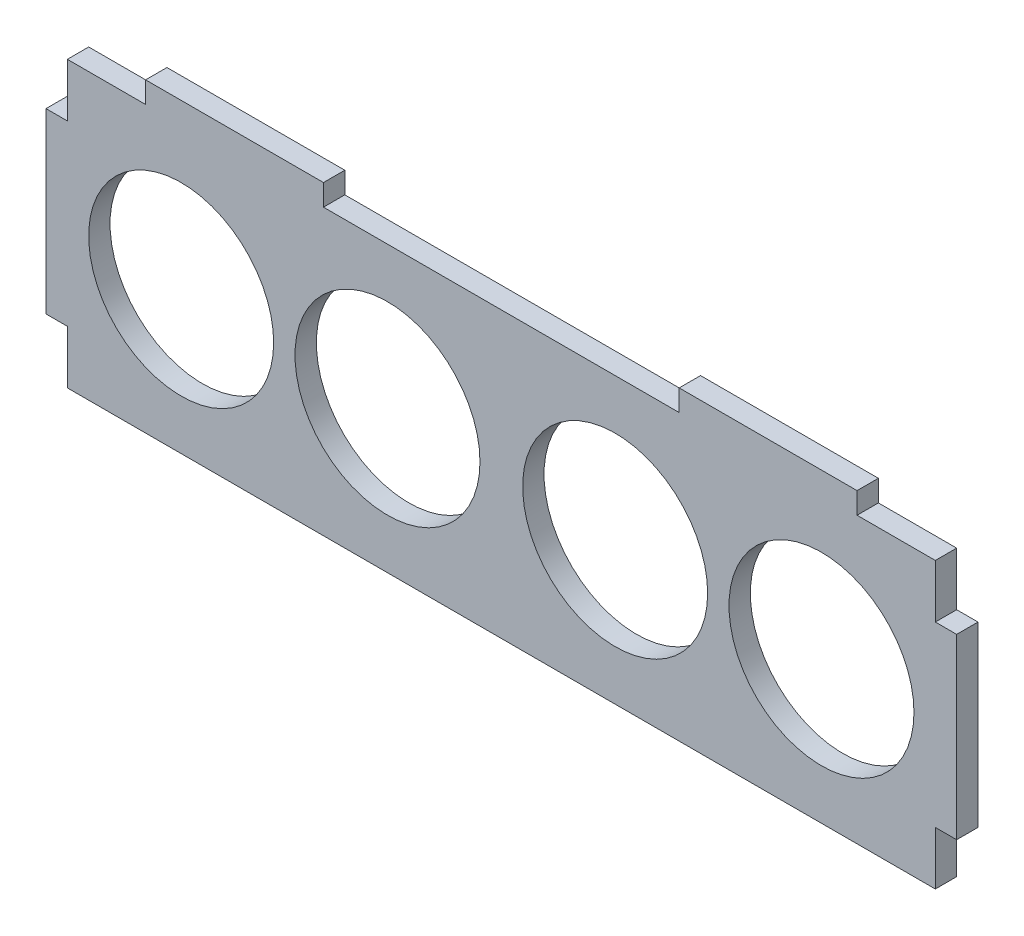
ISO-10303-21;
HEADER;
FILE_DESCRIPTION(('STEP AP214'),'2;1');
FILE_NAME('part.step','',(''),(''),'','','');
FILE_SCHEMA(('AUTOMOTIVE_DESIGN { 1 0 10303 214 1 1 1 1 }'));
ENDSEC;
DATA;
#1=APPLICATION_CONTEXT('core data for automotive mechanical design processes');
#2=APPLICATION_PROTOCOL_DEFINITION('international standard','automotive_design',2000,#1);
#3=PRODUCT_CONTEXT('',#1,'mechanical');
#4=PRODUCT('Part','Part','',(#3));
#5=PRODUCT_RELATED_PRODUCT_CATEGORY('part','',(#4));
#6=PRODUCT_DEFINITION_FORMATION('','',#4);
#7=PRODUCT_DEFINITION_CONTEXT('part definition',#1,'design');
#8=PRODUCT_DEFINITION('design','',#6,#7);
#9=PRODUCT_DEFINITION_SHAPE('','',#8);
#10=(LENGTH_UNIT() NAMED_UNIT(*) SI_UNIT(.MILLI.,.METRE.));
#11=(NAMED_UNIT(*) PLANE_ANGLE_UNIT() SI_UNIT($,.RADIAN.));
#12=(NAMED_UNIT(*) SI_UNIT($,.STERADIAN.) SOLID_ANGLE_UNIT());
#13=UNCERTAINTY_MEASURE_WITH_UNIT(LENGTH_MEASURE(1.E-05),#10,'distance_accuracy_value','');
#14=(GEOMETRIC_REPRESENTATION_CONTEXT(3) GLOBAL_UNCERTAINTY_ASSIGNED_CONTEXT((#13)) GLOBAL_UNIT_ASSIGNED_CONTEXT((#10,
#11,#12)) REPRESENTATION_CONTEXT('',''));
#15=CARTESIAN_POINT('',(0.,0.,0.));
#16=DIRECTION('',(0.,0.,1.));
#17=DIRECTION('',(1.,0.,0.));
#18=AXIS2_PLACEMENT_3D('',#15,#16,#17);
#19=CARTESIAN_POINT('',(0.,12.5,3.));
#20=DIRECTION('',(0.,-1.,0.));
#21=DIRECTION('',(0.,0.,-1.));
#22=AXIS2_PLACEMENT_3D('',#19,#20,#21);
#23=PLANE('',#22);
#24=DIRECTION('',(-1.,0.,0.));
#25=VECTOR('',#24,1.);
#26=CARTESIAN_POINT('',(0.,12.5,0.));
#27=LINE('',#26,#25);
#28=CARTESIAN_POINT('',(-61.,12.5,0.));
#29=VERTEX_POINT('',#28);
#30=CARTESIAN_POINT('',(-64.,12.5,0.));
#31=VERTEX_POINT('',#30);
#32=EDGE_CURVE('E339',#29,#31,#27,.T.);
#33=ORIENTED_EDGE('',*,*,#32,.T.);
#34=DIRECTION('',(0.,0.,-1.));
#35=VECTOR('',#34,1.);
#36=CARTESIAN_POINT('',(-64.,12.5,3.));
#37=LINE('',#36,#35);
#38=CARTESIAN_POINT('',(-64.,12.5,3.));
#39=VERTEX_POINT('',#38);
#40=EDGE_CURVE('E11',#39,#31,#37,.T.);
#41=ORIENTED_EDGE('',*,*,#40,.F.);
#42=DIRECTION('',(-1.,0.,0.));
#43=VECTOR('',#42,1.);
#44=CARTESIAN_POINT('',(0.,12.5,3.));
#45=LINE('',#44,#43);
#46=CARTESIAN_POINT('',(-61.,12.5,3.));
#47=VERTEX_POINT('',#46);
#48=EDGE_CURVE('E260',#47,#39,#45,.T.);
#49=ORIENTED_EDGE('',*,*,#48,.F.);
#50=DIRECTION('',(0.,0.,-1.));
#51=VECTOR('',#50,1.);
#52=CARTESIAN_POINT('',(-61.,12.5,3.));
#53=LINE('',#52,#51);
#54=EDGE_CURVE('E56',#47,#29,#53,.T.);
#55=ORIENTED_EDGE('',*,*,#54,.T.);
#56=EDGE_LOOP('',(#33,#41,#49,#55));
#57=FACE_BOUND('',#56,.T.);
#58=ADVANCED_FACE('F39',(#57),#23,.F.);
#59=CARTESIAN_POINT('',(-64.,0.,3.));
#60=DIRECTION('',(1.,0.,0.));
#61=DIRECTION('',(0.,0.,-1.));
#62=AXIS2_PLACEMENT_3D('',#59,#60,#61);
#63=PLANE('',#62);
#64=DIRECTION('',(0.,-1.,0.));
#65=VECTOR('',#64,1.);
#66=CARTESIAN_POINT('',(-64.,0.,0.));
#67=LINE('',#66,#65);
#68=CARTESIAN_POINT('',(-64.,-12.5,0.));
#69=VERTEX_POINT('',#68);
#70=EDGE_CURVE('E335',#31,#69,#67,.T.);
#71=ORIENTED_EDGE('',*,*,#70,.T.);
#72=DIRECTION('',(0.,0.,-1.));
#73=VECTOR('',#72,1.);
#74=CARTESIAN_POINT('',(-64.,-12.5,3.));
#75=LINE('',#74,#73);
#76=CARTESIAN_POINT('',(-64.,-12.5,3.));
#77=VERTEX_POINT('',#76);
#78=EDGE_CURVE('E48',#77,#69,#75,.T.);
#79=ORIENTED_EDGE('',*,*,#78,.F.);
#80=DIRECTION('',(0.,-1.,0.));
#81=VECTOR('',#80,1.);
#82=CARTESIAN_POINT('',(-64.,0.,3.));
#83=LINE('',#82,#81);
#84=EDGE_CURVE('E130',#39,#77,#83,.T.);
#85=ORIENTED_EDGE('',*,*,#84,.F.);
#86=ORIENTED_EDGE('',*,*,#40,.T.);
#87=EDGE_LOOP('',(#71,#79,#85,#86));
#88=FACE_BOUND('',#87,.T.);
#89=ADVANCED_FACE('F336',(#88),#63,.F.);
#90=CARTESIAN_POINT('',(0.,-12.5,3.));
#91=DIRECTION('',(0.,-1.,0.));
#92=DIRECTION('',(0.,0.,-1.));
#93=AXIS2_PLACEMENT_3D('',#90,#91,#92);
#94=PLANE('',#93);
#95=DIRECTION('',(-1.,0.,0.));
#96=VECTOR('',#95,1.);
#97=CARTESIAN_POINT('',(0.,-12.5,0.));
#98=LINE('',#97,#96);
#99=CARTESIAN_POINT('',(-61.,-12.5,0.));
#100=VERTEX_POINT('',#99);
#101=EDGE_CURVE('E332',#100,#69,#98,.T.);
#102=ORIENTED_EDGE('',*,*,#101,.F.);
#103=DIRECTION('',(0.,0.,-1.));
#104=VECTOR('',#103,1.);
#105=CARTESIAN_POINT('',(-61.,-12.5,3.));
#106=LINE('',#105,#104);
#107=CARTESIAN_POINT('',(-61.,-12.5,3.));
#108=VERTEX_POINT('',#107);
#109=EDGE_CURVE('E324',#108,#100,#106,.T.);
#110=ORIENTED_EDGE('',*,*,#109,.F.);
#111=DIRECTION('',(-1.,0.,0.));
#112=VECTOR('',#111,1.);
#113=CARTESIAN_POINT('',(0.,-12.5,3.));
#114=LINE('',#113,#112);
#115=EDGE_CURVE('E253',#108,#77,#114,.T.);
#116=ORIENTED_EDGE('',*,*,#115,.T.);
#117=ORIENTED_EDGE('',*,*,#78,.T.);
#118=EDGE_LOOP('',(#102,#110,#116,#117));
#119=FACE_BOUND('',#118,.T.);
#120=ADVANCED_FACE('F330',(#119),#94,.T.);
#121=CARTESIAN_POINT('',(-61.,0.,3.));
#122=DIRECTION('',(-1.,0.,0.));
#123=DIRECTION('',(0.,0.,1.));
#124=AXIS2_PLACEMENT_3D('',#121,#122,#123);
#125=PLANE('',#124);
#126=DIRECTION('',(0.,1.,0.));
#127=VECTOR('',#126,1.);
#128=CARTESIAN_POINT('',(-61.,0.,0.));
#129=LINE('',#128,#127);
#130=CARTESIAN_POINT('',(-61.,-20.,0.));
#131=VERTEX_POINT('',#130);
#132=EDGE_CURVE('E345',#131,#100,#129,.T.);
#133=ORIENTED_EDGE('',*,*,#132,.F.);
#134=DIRECTION('',(0.,0.,-1.));
#135=VECTOR('',#134,1.);
#136=CARTESIAN_POINT('',(-61.,-20.,3.));
#137=LINE('',#136,#135);
#138=CARTESIAN_POINT('',(-61.,-20.,3.));
#139=VERTEX_POINT('',#138);
#140=EDGE_CURVE('E321',#139,#131,#137,.T.);
#141=ORIENTED_EDGE('',*,*,#140,.F.);
#142=DIRECTION('',(0.,1.,0.));
#143=VECTOR('',#142,1.);
#144=CARTESIAN_POINT('',(-61.,0.,3.));
#145=LINE('',#144,#143);
#146=EDGE_CURVE('E214',#139,#108,#145,.T.);
#147=ORIENTED_EDGE('',*,*,#146,.T.);
#148=ORIENTED_EDGE('',*,*,#109,.T.);
#149=EDGE_LOOP('',(#133,#141,#147,#148));
#150=FACE_BOUND('',#149,.T.);
#151=ADVANCED_FACE('F508',(#150),#125,.T.);
#152=CARTESIAN_POINT('',(0.,-20.,3.));
#153=DIRECTION('',(0.,1.,0.));
#154=DIRECTION('',(0.,0.,1.));
#155=AXIS2_PLACEMENT_3D('',#152,#153,#154);
#156=PLANE('',#155);
#157=DIRECTION('',(1.,0.,0.));
#158=VECTOR('',#157,1.);
#159=CARTESIAN_POINT('',(0.,-20.,0.));
#160=LINE('',#159,#158);
#161=CARTESIAN_POINT('',(61.,-20.,0.));
#162=VERTEX_POINT('',#161);
#163=EDGE_CURVE('E349',#131,#162,#160,.T.);
#164=ORIENTED_EDGE('',*,*,#163,.T.);
#165=DIRECTION('',(0.,0.,-1.));
#166=VECTOR('',#165,1.);
#167=CARTESIAN_POINT('',(61.,-20.,3.));
#168=LINE('',#167,#166);
#169=CARTESIAN_POINT('',(61.,-20.,3.));
#170=VERTEX_POINT('',#169);
#171=EDGE_CURVE('E317',#170,#162,#168,.T.);
#172=ORIENTED_EDGE('',*,*,#171,.F.);
#173=DIRECTION('',(1.,0.,0.));
#174=VECTOR('',#173,1.);
#175=CARTESIAN_POINT('',(0.,-20.,3.));
#176=LINE('',#175,#174);
#177=EDGE_CURVE('E243',#139,#170,#176,.T.);
#178=ORIENTED_EDGE('',*,*,#177,.F.);
#179=ORIENTED_EDGE('',*,*,#140,.T.);
#180=EDGE_LOOP('',(#164,#172,#178,#179));
#181=FACE_BOUND('',#180,.T.);
#182=ADVANCED_FACE('F506',(#181),#156,.F.);
#183=CARTESIAN_POINT('',(61.,0.,3.));
#184=DIRECTION('',(-1.,0.,0.));
#185=DIRECTION('',(0.,0.,1.));
#186=AXIS2_PLACEMENT_3D('',#183,#184,#185);
#187=PLANE('',#186);
#188=DIRECTION('',(0.,1.,0.));
#189=VECTOR('',#188,1.);
#190=CARTESIAN_POINT('',(61.,0.,0.));
#191=LINE('',#190,#189);
#192=CARTESIAN_POINT('',(61.,-12.5,0.));
#193=VERTEX_POINT('',#192);
#194=EDGE_CURVE('E356',#162,#193,#191,.T.);
#195=ORIENTED_EDGE('',*,*,#194,.T.);
#196=DIRECTION('',(0.,0.,-1.));
#197=VECTOR('',#196,1.);
#198=CARTESIAN_POINT('',(61.,-12.5,3.));
#199=LINE('',#198,#197);
#200=CARTESIAN_POINT('',(61.,-12.5,3.));
#201=VERTEX_POINT('',#200);
#202=EDGE_CURVE('E313',#201,#193,#199,.T.);
#203=ORIENTED_EDGE('',*,*,#202,.F.);
#204=DIRECTION('',(0.,1.,0.));
#205=VECTOR('',#204,1.);
#206=CARTESIAN_POINT('',(61.,0.,3.));
#207=LINE('',#206,#205);
#208=EDGE_CURVE('E232',#170,#201,#207,.T.);
#209=ORIENTED_EDGE('',*,*,#208,.F.);
#210=ORIENTED_EDGE('',*,*,#171,.T.);
#211=EDGE_LOOP('',(#195,#203,#209,#210));
#212=FACE_BOUND('',#211,.T.);
#213=ADVANCED_FACE('F504',(#212),#187,.F.);
#214=CARTESIAN_POINT('',(0.,-12.4999999999999,3.));
#215=DIRECTION('',(0.,1.,0.));
#216=DIRECTION('',(-1.,0.,0.));
#217=AXIS2_PLACEMENT_3D('',#214,#215,#216);
#218=PLANE('',#217);
#219=DIRECTION('',(1.,0.,0.));
#220=VECTOR('',#219,1.);
#221=CARTESIAN_POINT('',(0.,-12.4999999999999,0.));
#222=LINE('',#221,#220);
#223=CARTESIAN_POINT('',(64.,-12.5,0.));
#224=VERTEX_POINT('',#223);
#225=EDGE_CURVE('E359',#193,#224,#222,.T.);
#226=ORIENTED_EDGE('',*,*,#225,.T.);
#227=DIRECTION('',(0.,0.,-1.));
#228=VECTOR('',#227,1.);
#229=CARTESIAN_POINT('',(64.,-12.5,3.));
#230=LINE('',#229,#228);
#231=CARTESIAN_POINT('',(64.,-12.5,3.));
#232=VERTEX_POINT('',#231);
#233=EDGE_CURVE('E310',#232,#224,#230,.T.);
#234=ORIENTED_EDGE('',*,*,#233,.F.);
#235=DIRECTION('',(1.,0.,0.));
#236=VECTOR('',#235,1.);
#237=CARTESIAN_POINT('',(0.,-12.4999999999999,3.));
#238=LINE('',#237,#236);
#239=EDGE_CURVE('E242',#201,#232,#238,.T.);
#240=ORIENTED_EDGE('',*,*,#239,.F.);
#241=ORIENTED_EDGE('',*,*,#202,.T.);
#242=EDGE_LOOP('',(#226,#234,#240,#241));
#243=FACE_BOUND('',#242,.T.);
#244=ADVANCED_FACE('F501',(#243),#218,.F.);
#245=CARTESIAN_POINT('',(64.,0.,3.));
#246=DIRECTION('',(1.,0.,0.));
#247=DIRECTION('',(0.,0.,-1.));
#248=AXIS2_PLACEMENT_3D('',#245,#246,#247);
#249=PLANE('',#248);
#250=DIRECTION('',(0.,-1.,0.));
#251=VECTOR('',#250,1.);
#252=CARTESIAN_POINT('',(64.,0.,0.));
#253=LINE('',#252,#251);
#254=CARTESIAN_POINT('',(64.,12.5,0.));
#255=VERTEX_POINT('',#254);
#256=EDGE_CURVE('E364',#255,#224,#253,.T.);
#257=ORIENTED_EDGE('',*,*,#256,.F.);
#258=DIRECTION('',(0.,0.,-1.));
#259=VECTOR('',#258,1.);
#260=CARTESIAN_POINT('',(64.,12.5,3.));
#261=LINE('',#260,#259);
#262=CARTESIAN_POINT('',(64.,12.5,3.));
#263=VERTEX_POINT('',#262);
#264=EDGE_CURVE('E307',#263,#255,#261,.T.);
#265=ORIENTED_EDGE('',*,*,#264,.F.);
#266=DIRECTION('',(0.,-1.,0.));
#267=VECTOR('',#266,1.);
#268=CARTESIAN_POINT('',(64.,0.,3.));
#269=LINE('',#268,#267);
#270=EDGE_CURVE('E238',#263,#232,#269,.T.);
#271=ORIENTED_EDGE('',*,*,#270,.T.);
#272=ORIENTED_EDGE('',*,*,#233,.T.);
#273=EDGE_LOOP('',(#257,#265,#271,#272));
#274=FACE_BOUND('',#273,.T.);
#275=ADVANCED_FACE('F496',(#274),#249,.T.);
#276=CARTESIAN_POINT('',(0.,12.5,3.));
#277=DIRECTION('',(0.,1.,0.));
#278=DIRECTION('',(0.,0.,1.));
#279=AXIS2_PLACEMENT_3D('',#276,#277,#278);
#280=PLANE('',#279);
#281=DIRECTION('',(1.,0.,0.));
#282=VECTOR('',#281,1.);
#283=CARTESIAN_POINT('',(0.,12.5,0.));
#284=LINE('',#283,#282);
#285=CARTESIAN_POINT('',(61.,12.5,0.));
#286=VERTEX_POINT('',#285);
#287=EDGE_CURVE('E368',#286,#255,#284,.T.);
#288=ORIENTED_EDGE('',*,*,#287,.F.);
#289=DIRECTION('',(0.,0.,-1.));
#290=VECTOR('',#289,1.);
#291=CARTESIAN_POINT('',(61.,12.5,3.));
#292=LINE('',#291,#290);
#293=CARTESIAN_POINT('',(61.,12.5,3.));
#294=VERTEX_POINT('',#293);
#295=EDGE_CURVE('E304',#294,#286,#292,.T.);
#296=ORIENTED_EDGE('',*,*,#295,.F.);
#297=DIRECTION('',(1.,0.,0.));
#298=VECTOR('',#297,1.);
#299=CARTESIAN_POINT('',(0.,12.5,3.));
#300=LINE('',#299,#298);
#301=EDGE_CURVE('E230',#294,#263,#300,.T.);
#302=ORIENTED_EDGE('',*,*,#301,.T.);
#303=ORIENTED_EDGE('',*,*,#264,.T.);
#304=EDGE_LOOP('',(#288,#296,#302,#303));
#305=FACE_BOUND('',#304,.T.);
#306=ADVANCED_FACE('F491',(#305),#280,.T.);
#307=CARTESIAN_POINT('',(61.,20.,0.));
#308=VERTEX_POINT('',#307);
#309=EDGE_CURVE('E360',#286,#308,#191,.T.);
#310=ORIENTED_EDGE('',*,*,#309,.T.);
#311=DIRECTION('',(0.,0.,-1.));
#312=VECTOR('',#311,1.);
#313=CARTESIAN_POINT('',(61.,20.,3.));
#314=LINE('',#313,#312);
#315=CARTESIAN_POINT('',(61.,20.,3.));
#316=VERTEX_POINT('',#315);
#317=EDGE_CURVE('E301',#316,#308,#314,.T.);
#318=ORIENTED_EDGE('',*,*,#317,.F.);
#319=EDGE_CURVE('E224',#294,#316,#207,.T.);
#320=ORIENTED_EDGE('',*,*,#319,.F.);
#321=ORIENTED_EDGE('',*,*,#295,.T.);
#322=EDGE_LOOP('',(#310,#318,#320,#321));
#323=FACE_BOUND('',#322,.T.);
#324=ADVANCED_FACE('F487',(#323),#187,.F.);
#325=CARTESIAN_POINT('',(0.,20.,3.));
#326=DIRECTION('',(0.,1.,0.));
#327=DIRECTION('',(0.,0.,1.));
#328=AXIS2_PLACEMENT_3D('',#325,#326,#327);
#329=PLANE('',#328);
#330=DIRECTION('',(1.,0.,0.));
#331=VECTOR('',#330,1.);
#332=CARTESIAN_POINT('',(0.,20.,0.));
#333=LINE('',#332,#331);
#334=CARTESIAN_POINT('',(50.,20.,0.));
#335=VERTEX_POINT('',#334);
#336=EDGE_CURVE('E372',#335,#308,#333,.T.);
#337=ORIENTED_EDGE('',*,*,#336,.F.);
#338=DIRECTION('',(0.,0.,-1.));
#339=VECTOR('',#338,1.);
#340=CARTESIAN_POINT('',(50.,20.,3.));
#341=LINE('',#340,#339);
#342=CARTESIAN_POINT('',(50.,20.,3.));
#343=VERTEX_POINT('',#342);
#344=EDGE_CURVE('E298',#343,#335,#341,.T.);
#345=ORIENTED_EDGE('',*,*,#344,.F.);
#346=DIRECTION('',(1.,0.,0.));
#347=VECTOR('',#346,1.);
#348=CARTESIAN_POINT('',(0.,20.,3.));
#349=LINE('',#348,#347);
#350=EDGE_CURVE('E210',#343,#316,#349,.T.);
#351=ORIENTED_EDGE('',*,*,#350,.T.);
#352=ORIENTED_EDGE('',*,*,#317,.T.);
#353=EDGE_LOOP('',(#337,#345,#351,#352));
#354=FACE_BOUND('',#353,.T.);
#355=ADVANCED_FACE('F484',(#354),#329,.T.);
#356=CARTESIAN_POINT('',(50.,0.,3.));
#357=DIRECTION('',(-1.,0.,0.));
#358=DIRECTION('',(0.,0.,1.));
#359=AXIS2_PLACEMENT_3D('',#356,#357,#358);
#360=PLANE('',#359);
#361=DIRECTION('',(0.,1.,0.));
#362=VECTOR('',#361,1.);
#363=CARTESIAN_POINT('',(50.,0.,0.));
#364=LINE('',#363,#362);
#365=CARTESIAN_POINT('',(50.,23.,0.));
#366=VERTEX_POINT('',#365);
#367=EDGE_CURVE('E376',#335,#366,#364,.T.);
#368=ORIENTED_EDGE('',*,*,#367,.T.);
#369=DIRECTION('',(0.,0.,-1.));
#370=VECTOR('',#369,1.);
#371=CARTESIAN_POINT('',(50.,23.,3.));
#372=LINE('',#371,#370);
#373=CARTESIAN_POINT('',(50.,23.,3.));
#374=VERTEX_POINT('',#373);
#375=EDGE_CURVE('E295',#374,#366,#372,.T.);
#376=ORIENTED_EDGE('',*,*,#375,.F.);
#377=DIRECTION('',(0.,1.,0.));
#378=VECTOR('',#377,1.);
#379=CARTESIAN_POINT('',(50.,0.,3.));
#380=LINE('',#379,#378);
#381=EDGE_CURVE('E223',#343,#374,#380,.T.);
#382=ORIENTED_EDGE('',*,*,#381,.F.);
#383=ORIENTED_EDGE('',*,*,#344,.T.);
#384=EDGE_LOOP('',(#368,#376,#382,#383));
#385=FACE_BOUND('',#384,.T.);
#386=ADVANCED_FACE('F625',(#385),#360,.F.);
#387=CARTESIAN_POINT('',(0.,23.,3.));
#388=DIRECTION('',(0.,1.,0.));
#389=DIRECTION('',(0.,0.,1.));
#390=AXIS2_PLACEMENT_3D('',#387,#388,#389);
#391=PLANE('',#390);
#392=DIRECTION('',(1.,0.,0.));
#393=VECTOR('',#392,1.);
#394=CARTESIAN_POINT('',(0.,23.,0.));
#395=LINE('',#394,#393);
#396=CARTESIAN_POINT('',(25.,23.,0.));
#397=VERTEX_POINT('',#396);
#398=EDGE_CURVE('E382',#397,#366,#395,.T.);
#399=ORIENTED_EDGE('',*,*,#398,.F.);
#400=DIRECTION('',(0.,0.,-1.));
#401=VECTOR('',#400,1.);
#402=CARTESIAN_POINT('',(25.,23.,3.));
#403=LINE('',#402,#401);
#404=CARTESIAN_POINT('',(25.,23.,3.));
#405=VERTEX_POINT('',#404);
#406=EDGE_CURVE('E292',#405,#397,#403,.T.);
#407=ORIENTED_EDGE('',*,*,#406,.F.);
#408=DIRECTION('',(1.,0.,0.));
#409=VECTOR('',#408,1.);
#410=CARTESIAN_POINT('',(0.,23.,3.));
#411=LINE('',#410,#409);
#412=EDGE_CURVE('E229',#405,#374,#411,.T.);
#413=ORIENTED_EDGE('',*,*,#412,.T.);
#414=ORIENTED_EDGE('',*,*,#375,.T.);
#415=EDGE_LOOP('',(#399,#407,#413,#414));
#416=FACE_BOUND('',#415,.T.);
#417=ADVANCED_FACE('F457',(#416),#391,.T.);
#418=CARTESIAN_POINT('',(25.,0.,3.));
#419=DIRECTION('',(-1.,0.,0.));
#420=DIRECTION('',(0.,0.,1.));
#421=AXIS2_PLACEMENT_3D('',#418,#419,#420);
#422=PLANE('',#421);
#423=DIRECTION('',(0.,1.,0.));
#424=VECTOR('',#423,1.);
#425=CARTESIAN_POINT('',(25.,0.,0.));
#426=LINE('',#425,#424);
#427=CARTESIAN_POINT('',(25.,20.,0.));
#428=VERTEX_POINT('',#427);
#429=EDGE_CURVE('E386',#428,#397,#426,.T.);
#430=ORIENTED_EDGE('',*,*,#429,.F.);
#431=DIRECTION('',(0.,0.,-1.));
#432=VECTOR('',#431,1.);
#433=CARTESIAN_POINT('',(25.,20.,3.));
#434=LINE('',#433,#432);
#435=CARTESIAN_POINT('',(25.,20.,3.));
#436=VERTEX_POINT('',#435);
#437=EDGE_CURVE('E289',#436,#428,#434,.T.);
#438=ORIENTED_EDGE('',*,*,#437,.F.);
#439=DIRECTION('',(0.,1.,0.));
#440=VECTOR('',#439,1.);
#441=CARTESIAN_POINT('',(25.,0.,3.));
#442=LINE('',#441,#440);
#443=EDGE_CURVE('E220',#436,#405,#442,.T.);
#444=ORIENTED_EDGE('',*,*,#443,.T.);
#445=ORIENTED_EDGE('',*,*,#406,.T.);
#446=EDGE_LOOP('',(#430,#438,#444,#445));
#447=FACE_BOUND('',#446,.T.);
#448=ADVANCED_FACE('F464',(#447),#422,.T.);
#449=CARTESIAN_POINT('',(-24.9999999999999,20.,0.));
#450=VERTEX_POINT('',#449);
#451=EDGE_CURVE('E378',#450,#428,#333,.T.);
#452=ORIENTED_EDGE('',*,*,#451,.F.);
#453=DIRECTION('',(0.,0.,-1.));
#454=VECTOR('',#453,1.);
#455=CARTESIAN_POINT('',(-24.9999999999999,20.,3.));
#456=LINE('',#455,#454);
#457=CARTESIAN_POINT('',(-24.9999999999999,20.,3.));
#458=VERTEX_POINT('',#457);
#459=EDGE_CURVE('E286',#458,#450,#456,.T.);
#460=ORIENTED_EDGE('',*,*,#459,.F.);
#461=EDGE_CURVE('E209',#458,#436,#349,.T.);
#462=ORIENTED_EDGE('',*,*,#461,.T.);
#463=ORIENTED_EDGE('',*,*,#437,.T.);
#464=EDGE_LOOP('',(#452,#460,#462,#463));
#465=FACE_BOUND('',#464,.T.);
#466=ADVANCED_FACE('F468',(#465),#329,.T.);
#467=CARTESIAN_POINT('',(-24.9999999999999,0.,3.));
#468=DIRECTION('',(-1.,0.,0.));
#469=DIRECTION('',(0.,0.,1.));
#470=AXIS2_PLACEMENT_3D('',#467,#468,#469);
#471=PLANE('',#470);
#472=DIRECTION('',(0.,1.,0.));
#473=VECTOR('',#472,1.);
#474=CARTESIAN_POINT('',(-24.9999999999999,0.,0.));
#475=LINE('',#474,#473);
#476=CARTESIAN_POINT('',(-24.9999999999999,23.,0.));
#477=VERTEX_POINT('',#476);
#478=EDGE_CURVE('E390',#450,#477,#475,.T.);
#479=ORIENTED_EDGE('',*,*,#478,.T.);
#480=DIRECTION('',(0.,0.,-1.));
#481=VECTOR('',#480,1.);
#482=CARTESIAN_POINT('',(-24.9999999999999,23.,3.));
#483=LINE('',#482,#481);
#484=CARTESIAN_POINT('',(-24.9999999999999,23.,3.));
#485=VERTEX_POINT('',#484);
#486=EDGE_CURVE('E283',#485,#477,#483,.T.);
#487=ORIENTED_EDGE('',*,*,#486,.F.);
#488=DIRECTION('',(0.,1.,0.));
#489=VECTOR('',#488,1.);
#490=CARTESIAN_POINT('',(-24.9999999999999,0.,3.));
#491=LINE('',#490,#489);
#492=EDGE_CURVE('E219',#458,#485,#491,.T.);
#493=ORIENTED_EDGE('',*,*,#492,.F.);
#494=ORIENTED_EDGE('',*,*,#459,.T.);
#495=EDGE_LOOP('',(#479,#487,#493,#494));
#496=FACE_BOUND('',#495,.T.);
#497=ADVANCED_FACE('F472',(#496),#471,.F.);
#498=CARTESIAN_POINT('',(0.,23.,3.));
#499=DIRECTION('',(0.,1.,0.));
#500=DIRECTION('',(0.,0.,1.));
#501=AXIS2_PLACEMENT_3D('',#498,#499,#500);
#502=PLANE('',#501);
#503=DIRECTION('',(1.,0.,0.));
#504=VECTOR('',#503,1.);
#505=CARTESIAN_POINT('',(0.,23.,0.));
#506=LINE('',#505,#504);
#507=CARTESIAN_POINT('',(-49.9999999999999,23.,0.));
#508=VERTEX_POINT('',#507);
#509=EDGE_CURVE('E394',#508,#477,#506,.T.);
#510=ORIENTED_EDGE('',*,*,#509,.F.);
#511=DIRECTION('',(0.,0.,-1.));
#512=VECTOR('',#511,1.);
#513=CARTESIAN_POINT('',(-49.9999999999999,23.,3.));
#514=LINE('',#513,#512);
#515=CARTESIAN_POINT('',(-49.9999999999999,23.,3.));
#516=VERTEX_POINT('',#515);
#517=EDGE_CURVE('E192',#516,#508,#514,.T.);
#518=ORIENTED_EDGE('',*,*,#517,.F.);
#519=DIRECTION('',(1.,0.,0.));
#520=VECTOR('',#519,1.);
#521=CARTESIAN_POINT('',(0.,23.,3.));
#522=LINE('',#521,#520);
#523=EDGE_CURVE('E202',#516,#485,#522,.T.);
#524=ORIENTED_EDGE('',*,*,#523,.T.);
#525=ORIENTED_EDGE('',*,*,#486,.T.);
#526=EDGE_LOOP('',(#510,#518,#524,#525));
#527=FACE_BOUND('',#526,.T.);
#528=ADVANCED_FACE('F476',(#527),#502,.T.);
#529=CARTESIAN_POINT('',(-49.9999999999999,0.,3.));
#530=DIRECTION('',(-1.,0.,0.));
#531=DIRECTION('',(0.,0.,1.));
#532=AXIS2_PLACEMENT_3D('',#529,#530,#531);
#533=PLANE('',#532);
#534=DIRECTION('',(0.,1.,0.));
#535=VECTOR('',#534,1.);
#536=CARTESIAN_POINT('',(-49.9999999999999,0.,0.));
#537=LINE('',#536,#535);
#538=CARTESIAN_POINT('',(-49.9999999999999,20.,0.));
#539=VERTEX_POINT('',#538);
#540=EDGE_CURVE('E187',#539,#508,#537,.T.);
#541=ORIENTED_EDGE('',*,*,#540,.F.);
#542=DIRECTION('',(0.,0.,-1.));
#543=VECTOR('',#542,1.);
#544=CARTESIAN_POINT('',(-49.9999999999999,20.,3.));
#545=LINE('',#544,#543);
#546=CARTESIAN_POINT('',(-49.9999999999999,20.,3.));
#547=VERTEX_POINT('',#546);
#548=EDGE_CURVE('E182',#547,#539,#545,.T.);
#549=ORIENTED_EDGE('',*,*,#548,.F.);
#550=DIRECTION('',(0.,1.,0.));
#551=VECTOR('',#550,1.);
#552=CARTESIAN_POINT('',(-49.9999999999999,0.,3.));
#553=LINE('',#552,#551);
#554=EDGE_CURVE('E185',#547,#516,#553,.T.);
#555=ORIENTED_EDGE('',*,*,#554,.T.);
#556=ORIENTED_EDGE('',*,*,#517,.T.);
#557=EDGE_LOOP('',(#541,#549,#555,#556));
#558=FACE_BOUND('',#557,.T.);
#559=ADVANCED_FACE('F184',(#558),#533,.T.);
#560=CARTESIAN_POINT('',(-61.,20.,0.));
#561=VERTEX_POINT('',#560);
#562=EDGE_CURVE('E377',#561,#539,#333,.T.);
#563=ORIENTED_EDGE('',*,*,#562,.F.);
#564=DIRECTION('',(0.,0.,-1.));
#565=VECTOR('',#564,1.);
#566=CARTESIAN_POINT('',(-61.,20.,3.));
#567=LINE('',#566,#565);
#568=CARTESIAN_POINT('',(-61.,20.,3.));
#569=VERTEX_POINT('',#568);
#570=EDGE_CURVE('E118',#569,#561,#567,.T.);
#571=ORIENTED_EDGE('',*,*,#570,.F.);
#572=EDGE_CURVE('E200',#569,#547,#349,.T.);
#573=ORIENTED_EDGE('',*,*,#572,.T.);
#574=ORIENTED_EDGE('',*,*,#548,.T.);
#575=EDGE_LOOP('',(#563,#571,#573,#574));
#576=FACE_BOUND('',#575,.T.);
#577=ADVANCED_FACE('F205',(#576),#329,.T.);
#578=CARTESIAN_POINT('',(45.,0.,3.));
#579=DIRECTION('',(0.,0.,-1.));
#580=DIRECTION('',(-1.,0.,0.));
#581=AXIS2_PLACEMENT_3D('',#578,#579,#580);
#582=CYLINDRICAL_SURFACE('',#581,13.);
#583=CARTESIAN_POINT('',(45.,0.,3.));
#584=DIRECTION('',(0.,0.,1.));
#585=DIRECTION('',(1.,0.,0.));
#586=AXIS2_PLACEMENT_3D('',#583,#584,#585);
#587=CIRCLE('',#586,13.);
#588=CARTESIAN_POINT('',(58.,0.,3.));
#589=VERTEX_POINT('',#588);
#590=EDGE_CURVE('E435',#589,#589,#587,.T.);
#591=ORIENTED_EDGE('',*,*,#590,.T.);
#592=EDGE_LOOP('',(#591));
#593=FACE_BOUND('',#592,.T.);
#594=CARTESIAN_POINT('',(45.,0.,0.));
#595=DIRECTION('',(0.,0.,1.));
#596=DIRECTION('',(1.,0.,0.));
#597=AXIS2_PLACEMENT_3D('',#594,#595,#596);
#598=CIRCLE('',#597,13.);
#599=CARTESIAN_POINT('',(58.,0.,0.));
#600=VERTEX_POINT('',#599);
#601=EDGE_CURVE('E266',#600,#600,#598,.T.);
#602=ORIENTED_EDGE('',*,*,#601,.F.);
#603=EDGE_LOOP('',(#602));
#604=FACE_BOUND('',#603,.T.);
#605=ADVANCED_FACE('F412',(#593,#604),#582,.F.);
#606=CARTESIAN_POINT('',(-16.,0.,3.));
#607=DIRECTION('',(0.,0.,-1.));
#608=DIRECTION('',(-1.,0.,0.));
#609=AXIS2_PLACEMENT_3D('',#606,#607,#608);
#610=CYLINDRICAL_SURFACE('',#609,13.);
#611=CARTESIAN_POINT('',(-16.,0.,3.));
#612=DIRECTION('',(0.,0.,1.));
#613=DIRECTION('',(1.,0.,0.));
#614=AXIS2_PLACEMENT_3D('',#611,#612,#613);
#615=CIRCLE('',#614,13.);
#616=CARTESIAN_POINT('',(-3.,0.,3.));
#617=VERTEX_POINT('',#616);
#618=EDGE_CURVE('E439',#617,#617,#615,.T.);
#619=ORIENTED_EDGE('',*,*,#618,.T.);
#620=EDGE_LOOP('',(#619));
#621=FACE_BOUND('',#620,.T.);
#622=CARTESIAN_POINT('',(-16.,0.,0.));
#623=DIRECTION('',(0.,0.,1.));
#624=DIRECTION('',(1.,0.,0.));
#625=AXIS2_PLACEMENT_3D('',#622,#623,#624);
#626=CIRCLE('',#625,13.);
#627=CARTESIAN_POINT('',(-3.,0.,0.));
#628=VERTEX_POINT('',#627);
#629=EDGE_CURVE('E272',#628,#628,#626,.T.);
#630=ORIENTED_EDGE('',*,*,#629,.F.);
#631=EDGE_LOOP('',(#630));
#632=FACE_BOUND('',#631,.T.);
#633=ADVANCED_FACE('F409',(#621,#632),#610,.F.);
#634=CARTESIAN_POINT('',(16.,0.,3.));
#635=DIRECTION('',(0.,0.,-1.));
#636=DIRECTION('',(-1.,0.,0.));
#637=AXIS2_PLACEMENT_3D('',#634,#635,#636);
#638=CYLINDRICAL_SURFACE('',#637,13.);
#639=CARTESIAN_POINT('',(16.,0.,3.));
#640=DIRECTION('',(0.,0.,1.));
#641=DIRECTION('',(1.,0.,0.));
#642=AXIS2_PLACEMENT_3D('',#639,#640,#641);
#643=CIRCLE('',#642,13.);
#644=CARTESIAN_POINT('',(29.,0.,3.));
#645=VERTEX_POINT('',#644);
#646=EDGE_CURVE('E212',#645,#645,#643,.T.);
#647=ORIENTED_EDGE('',*,*,#646,.T.);
#648=EDGE_LOOP('',(#647));
#649=FACE_BOUND('',#648,.T.);
#650=CARTESIAN_POINT('',(16.,0.,0.));
#651=DIRECTION('',(0.,0.,1.));
#652=DIRECTION('',(1.,0.,0.));
#653=AXIS2_PLACEMENT_3D('',#650,#651,#652);
#654=CIRCLE('',#653,13.);
#655=CARTESIAN_POINT('',(29.,0.,0.));
#656=VERTEX_POINT('',#655);
#657=EDGE_CURVE('E400',#656,#656,#654,.T.);
#658=ORIENTED_EDGE('',*,*,#657,.F.);
#659=EDGE_LOOP('',(#658));
#660=FACE_BOUND('',#659,.T.);
#661=ADVANCED_FACE('F411',(#649,#660),#638,.F.);
#662=EDGE_CURVE('E351',#29,#561,#129,.T.);
#663=ORIENTED_EDGE('',*,*,#662,.F.);
#664=ORIENTED_EDGE('',*,*,#54,.F.);
#665=EDGE_CURVE('E207',#47,#569,#145,.T.);
#666=ORIENTED_EDGE('',*,*,#665,.T.);
#667=ORIENTED_EDGE('',*,*,#570,.T.);
#668=EDGE_LOOP('',(#663,#664,#666,#667));
#669=FACE_BOUND('',#668,.T.);
#670=ADVANCED_FACE('F419',(#669),#125,.T.);
#671=CARTESIAN_POINT('',(-45.,0.,3.));
#672=DIRECTION('',(0.,0.,-1.));
#673=DIRECTION('',(-1.,0.,0.));
#674=AXIS2_PLACEMENT_3D('',#671,#672,#673);
#675=CYLINDRICAL_SURFACE('',#674,13.);
#676=CARTESIAN_POINT('',(-45.,0.,3.));
#677=DIRECTION('',(0.,0.,1.));
#678=DIRECTION('',(1.,0.,0.));
#679=AXIS2_PLACEMENT_3D('',#676,#677,#678);
#680=CIRCLE('',#679,13.);
#681=CARTESIAN_POINT('',(-32.,0.,3.));
#682=VERTEX_POINT('',#681);
#683=EDGE_CURVE('E278',#682,#682,#680,.T.);
#684=ORIENTED_EDGE('',*,*,#683,.T.);
#685=EDGE_LOOP('',(#684));
#686=FACE_BOUND('',#685,.T.);
#687=CARTESIAN_POINT('',(-45.,0.,0.));
#688=DIRECTION('',(0.,0.,1.));
#689=DIRECTION('',(1.,0.,0.));
#690=AXIS2_PLACEMENT_3D('',#687,#688,#689);
#691=CIRCLE('',#690,13.);
#692=CARTESIAN_POINT('',(-32.,0.,0.));
#693=VERTEX_POINT('',#692);
#694=EDGE_CURVE('E262',#693,#693,#691,.T.);
#695=ORIENTED_EDGE('',*,*,#694,.F.);
#696=EDGE_LOOP('',(#695));
#697=FACE_BOUND('',#696,.T.);
#698=ADVANCED_FACE('F519',(#686,#697),#675,.F.);
#699=CARTESIAN_POINT('',(0.,0.,3.));
#700=DIRECTION('',(0.,0.,1.));
#701=DIRECTION('',(1.,0.,0.));
#702=AXIS2_PLACEMENT_3D('',#699,#700,#701);
#703=PLANE('',#702);
#704=ORIENTED_EDGE('',*,*,#48,.T.);
#705=ORIENTED_EDGE('',*,*,#84,.T.);
#706=ORIENTED_EDGE('',*,*,#115,.F.);
#707=ORIENTED_EDGE('',*,*,#146,.F.);
#708=ORIENTED_EDGE('',*,*,#177,.T.);
#709=ORIENTED_EDGE('',*,*,#208,.T.);
#710=ORIENTED_EDGE('',*,*,#239,.T.);
#711=ORIENTED_EDGE('',*,*,#270,.F.);
#712=ORIENTED_EDGE('',*,*,#301,.F.);
#713=ORIENTED_EDGE('',*,*,#319,.T.);
#714=ORIENTED_EDGE('',*,*,#350,.F.);
#715=ORIENTED_EDGE('',*,*,#381,.T.);
#716=ORIENTED_EDGE('',*,*,#412,.F.);
#717=ORIENTED_EDGE('',*,*,#443,.F.);
#718=ORIENTED_EDGE('',*,*,#461,.F.);
#719=ORIENTED_EDGE('',*,*,#492,.T.);
#720=ORIENTED_EDGE('',*,*,#523,.F.);
#721=ORIENTED_EDGE('',*,*,#554,.F.);
#722=ORIENTED_EDGE('',*,*,#572,.F.);
#723=ORIENTED_EDGE('',*,*,#665,.F.);
#724=EDGE_LOOP('',(#704,#705,#706,#707,#708,#709,#710,#711,#712,#713,#714,#715,#716,#717,#718,
#719,#720,#721,#722,#723));
#725=FACE_BOUND('',#724,.T.);
#726=ORIENTED_EDGE('',*,*,#646,.F.);
#727=EDGE_LOOP('',(#726));
#728=FACE_BOUND('',#727,.T.);
#729=ORIENTED_EDGE('',*,*,#618,.F.);
#730=EDGE_LOOP('',(#729));
#731=FACE_BOUND('',#730,.T.);
#732=ORIENTED_EDGE('',*,*,#590,.F.);
#733=EDGE_LOOP('',(#732));
#734=FACE_BOUND('',#733,.T.);
#735=ORIENTED_EDGE('',*,*,#683,.F.);
#736=EDGE_LOOP('',(#735));
#737=FACE_BOUND('',#736,.T.);
#738=ADVANCED_FACE('F197',(#725,#728,#731,#734,#737),#703,.T.);
#739=CARTESIAN_POINT('',(0.,0.,0.));
#740=DIRECTION('',(0.,0.,1.));
#741=DIRECTION('',(1.,0.,0.));
#742=AXIS2_PLACEMENT_3D('',#739,#740,#741);
#743=PLANE('',#742);
#744=ORIENTED_EDGE('',*,*,#32,.F.);
#745=ORIENTED_EDGE('',*,*,#662,.T.);
#746=ORIENTED_EDGE('',*,*,#562,.T.);
#747=ORIENTED_EDGE('',*,*,#540,.T.);
#748=ORIENTED_EDGE('',*,*,#509,.T.);
#749=ORIENTED_EDGE('',*,*,#478,.F.);
#750=ORIENTED_EDGE('',*,*,#451,.T.);
#751=ORIENTED_EDGE('',*,*,#429,.T.);
#752=ORIENTED_EDGE('',*,*,#398,.T.);
#753=ORIENTED_EDGE('',*,*,#367,.F.);
#754=ORIENTED_EDGE('',*,*,#336,.T.);
#755=ORIENTED_EDGE('',*,*,#309,.F.);
#756=ORIENTED_EDGE('',*,*,#287,.T.);
#757=ORIENTED_EDGE('',*,*,#256,.T.);
#758=ORIENTED_EDGE('',*,*,#225,.F.);
#759=ORIENTED_EDGE('',*,*,#194,.F.);
#760=ORIENTED_EDGE('',*,*,#163,.F.);
#761=ORIENTED_EDGE('',*,*,#132,.T.);
#762=ORIENTED_EDGE('',*,*,#101,.T.);
#763=ORIENTED_EDGE('',*,*,#70,.F.);
#764=EDGE_LOOP('',(#744,#745,#746,#747,#748,#749,#750,#751,#752,#753,#754,#755,#756,#757,#758,
#759,#760,#761,#762,#763));
#765=FACE_BOUND('',#764,.T.);
#766=ORIENTED_EDGE('',*,*,#657,.T.);
#767=EDGE_LOOP('',(#766));
#768=FACE_BOUND('',#767,.T.);
#769=ORIENTED_EDGE('',*,*,#629,.T.);
#770=EDGE_LOOP('',(#769));
#771=FACE_BOUND('',#770,.T.);
#772=ORIENTED_EDGE('',*,*,#601,.T.);
#773=EDGE_LOOP('',(#772));
#774=FACE_BOUND('',#773,.T.);
#775=ORIENTED_EDGE('',*,*,#694,.T.);
#776=EDGE_LOOP('',(#775));
#777=FACE_BOUND('',#776,.T.);
#778=ADVANCED_FACE('F341',(#765,#768,#771,#774,#777),#743,.F.);
#779=CLOSED_SHELL('',(#58,#89,#120,#151,#182,#213,#244,#275,#306,#324,#355,#386,#417,#448,#466,
#497,#528,#559,#577,#605,#633,#661,#670,#698,#738,#778));
#780=MANIFOLD_SOLID_BREP('B2',#779);
#781=ADVANCED_BREP_SHAPE_REPRESENTATION('',(#18,#780),#14);
#782=SHAPE_DEFINITION_REPRESENTATION(#9,#781);
ENDSEC;
END-ISO-10303-21;
